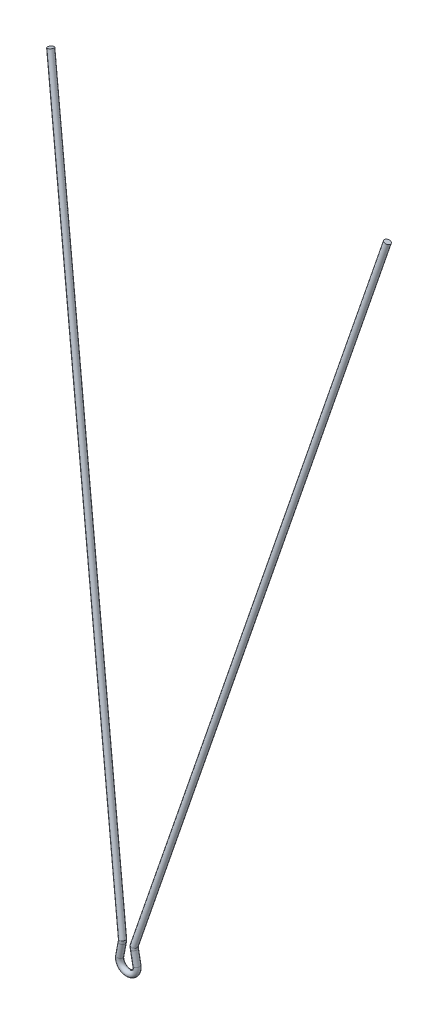
ISO-10303-21;
HEADER;
FILE_DESCRIPTION(('STEP AP214'),'2;1');
FILE_NAME('part.step','',(''),(''),'','','');
FILE_SCHEMA(('AUTOMOTIVE_DESIGN { 1 0 10303 214 1 1 1 1 }'));
ENDSEC;
DATA;
#1=APPLICATION_CONTEXT('core data for automotive mechanical design processes');
#2=APPLICATION_PROTOCOL_DEFINITION('international standard','automotive_design',2000,#1);
#3=PRODUCT_CONTEXT('',#1,'mechanical');
#4=PRODUCT('Part','Part','',(#3));
#5=PRODUCT_RELATED_PRODUCT_CATEGORY('part','',(#4));
#6=PRODUCT_DEFINITION_FORMATION('','',#4);
#7=PRODUCT_DEFINITION_CONTEXT('part definition',#1,'design');
#8=PRODUCT_DEFINITION('design','',#6,#7);
#9=PRODUCT_DEFINITION_SHAPE('','',#8);
#10=(LENGTH_UNIT() NAMED_UNIT(*) SI_UNIT(.MILLI.,.METRE.));
#11=(NAMED_UNIT(*) PLANE_ANGLE_UNIT() SI_UNIT($,.RADIAN.));
#12=(NAMED_UNIT(*) SI_UNIT($,.STERADIAN.) SOLID_ANGLE_UNIT());
#13=UNCERTAINTY_MEASURE_WITH_UNIT(LENGTH_MEASURE(1.E-05),#10,'distance_accuracy_value','');
#14=(GEOMETRIC_REPRESENTATION_CONTEXT(3) GLOBAL_UNCERTAINTY_ASSIGNED_CONTEXT((#13)) GLOBAL_UNIT_ASSIGNED_CONTEXT((#10,
#11,#12)) REPRESENTATION_CONTEXT('',''));
#15=CARTESIAN_POINT('',(0.,0.,0.));
#16=DIRECTION('',(0.,0.,1.));
#17=DIRECTION('',(1.,0.,0.));
#18=AXIS2_PLACEMENT_3D('',#15,#16,#17);
#19=CARTESIAN_POINT('',(-4.42141359605702,0.837318226603323,0.));
#20=DIRECTION('',(0.186070717022958,0.98253635467934,0.));
#21=DIRECTION('',(-0.98253635467934,0.186070717022958,0.));
#22=AXIS2_PLACEMENT_3D('',#19,#20,#21);
#23=CYLINDRICAL_SURFACE('',#22,1.5);
#24=CARTESIAN_POINT('',(-4.42141359605702,0.837318226603323,0.));
#25=DIRECTION('',(-0.18607071702296,-0.982536354679339,0.));
#26=DIRECTION('',(0.,0.,-1.));
#27=AXIS2_PLACEMENT_3D('',#24,#25,#26);
#28=CIRCLE('',#27,1.5);
#29=CARTESIAN_POINT('',(-5.89521812807603,1.11642430213776,0.));
#30=VERTEX_POINT('',#29);
#31=EDGE_CURVE('E10',#30,#30,#28,.T.);
#32=ORIENTED_EDGE('',*,*,#31,.F.);
#33=EDGE_LOOP('',(#32));
#34=FACE_BOUND('',#33,.T.);
#35=CARTESIAN_POINT('',(-3.12224551724466,7.69750498083926,0.));
#36=DIRECTION('',(-0.18607071702296,-0.982536354679339,0.));
#37=DIRECTION('',(0.,0.,-1.));
#38=AXIS2_PLACEMENT_3D('',#35,#36,#37);
#39=CIRCLE('',#38,1.5);
#40=CARTESIAN_POINT('',(-3.12224551724466,7.69750498083926,-1.50000000000004));
#41=VERTEX_POINT('',#40);
#42=EDGE_CURVE('E35',#41,#41,#39,.T.);
#43=ORIENTED_EDGE('',*,*,#42,.T.);
#44=EDGE_LOOP('',(#43));
#45=FACE_BOUND('',#44,.T.);
#46=ADVANCED_FACE('F29',(#34,#45),#23,.T.);
#47=CARTESIAN_POINT('',(0.,0.,0.));
#48=DIRECTION('',(0.,0.,1.));
#49=DIRECTION('',(1.,0.,0.));
#50=AXIS2_PLACEMENT_3D('',#47,#48,#49);
#51=TOROIDAL_SURFACE('',#50,4.5,1.5);
#52=CARTESIAN_POINT('',(4.42141359605697,0.837318226603212,0.));
#53=DIRECTION('',(-0.18607071702296,0.982536354679339,0.));
#54=DIRECTION('',(0.,0.,-1.));
#55=AXIS2_PLACEMENT_3D('',#52,#53,#54);
#56=CIRCLE('',#55,1.5);
#57=CARTESIAN_POINT('',(5.89521812807605,1.11642430213763,0.));
#58=VERTEX_POINT('',#57);
#59=EDGE_CURVE('E56',#58,#58,#56,.T.);
#60=CARTESIAN_POINT('',(0.,0.,0.));
#61=DIRECTION('',(0.,0.,1.));
#62=DIRECTION('',(1.,0.,0.));
#63=AXIS2_PLACEMENT_3D('',#60,#61,#62);
#64=CIRCLE('',#63,6.);
#65=EDGE_CURVE('',#30,#58,#64,.T.);
#66=ORIENTED_EDGE('',*,*,#31,.T.);
#67=ORIENTED_EDGE('',*,*,#59,.F.);
#68=ORIENTED_EDGE('',*,*,#65,.T.);
#69=ORIENTED_EDGE('',*,*,#65,.F.);
#70=EDGE_LOOP('',(#66,#68,#67,#69));
#71=FACE_BOUND('',#70,.T.);
#72=ADVANCED_FACE('F89',(#71),#51,.T.);
#73=CARTESIAN_POINT('',(-3.12224551724466,7.69750498083921,-1.50000000000004));
#74=CARTESIAN_POINT('',(-3.09753527008533,7.82798610412144,-1.50000000000004));
#75=CARTESIAN_POINT('',(-3.05694697284126,8.07293599759351,-1.50000000000006));
#76=CARTESIAN_POINT('',(-3.01033102219039,8.56531309695108,-1.49999999999997));
#77=CARTESIAN_POINT('',(-3.,8.71745364408555,-1.50000000000025));
#78=CARTESIAN_POINT('',(-2.99999999999995,8.89669872727467,-1.50000000000025));
#79=CARTESIAN_POINT('',(-0.174636453206561,7.13929282977048,-1.50000000000003));
#80=CARTESIAN_POINT('',(-0.149926206047285,7.2697739530525,-1.50000000000003));
#81=CARTESIAN_POINT('',(-0.0767177589849621,7.72923151361028,-1.49999999999999));
#82=CARTESIAN_POINT('',(-0.0167989694493387,8.25151540603849,-1.5000000000002));
#83=CARTESIAN_POINT('',(0.,8.98435932243366,-1.49999999999949));
#84=CARTESIAN_POINT('',(0.,9.2668262855756,-1.49999999999949));
#85=CARTESIAN_POINT('',(-0.174636453206561,7.13929282977052,1.49999999999997));
#86=CARTESIAN_POINT('',(-0.149926206047285,7.2697739530525,1.49999999999997));
#87=CARTESIAN_POINT('',(-0.0767177589848789,7.74470362085609,1.50000000000004));
#88=CARTESIAN_POINT('',(-0.0167989694492138,8.18958740647185,1.49999999999968));
#89=CARTESIAN_POINT('',(-2.08166817117217E-13,9.19096186788426,1.50000000000094));
#90=CARTESIAN_POINT('',(-1.66533453693773E-13,9.47342883102628,1.50000000000094));
#91=CARTESIAN_POINT('',(-3.12224551724466,7.69750498083926,1.49999999999996));
#92=CARTESIAN_POINT('',(-3.09753527008533,7.82798610412144,1.49999999999996));
#93=CARTESIAN_POINT('',(-3.05694697284142,8.08454305082168,1.49999999999997));
#94=CARTESIAN_POINT('',(-3.01033102219034,8.51885519849832,1.4999999999999));
#95=CARTESIAN_POINT('',(-3.00000000000006,8.87244524955982,1.50000000000017));
#96=CARTESIAN_POINT('',(-3.00000000000006,9.10330127272529,1.50000000000017));
#97=CARTESIAN_POINT('',(-6.06985458128265,8.25571713190823,1.5));
#98=CARTESIAN_POINT('',(-6.04514433412329,8.3861982551903,1.5));
#99=CARTESIAN_POINT('',(-6.03717618669783,8.4243824807873,1.49999999999996));
#100=CARTESIAN_POINT('',(-6.00386307493136,8.84812299052484,1.50000000000017));
#101=CARTESIAN_POINT('',(-5.99999999999988,8.55392863123538,1.49999999999946));
#102=CARTESIAN_POINT('',(-5.99999999999988,8.73317371442442,1.49999999999946));
#103=CARTESIAN_POINT('',(-6.06985458128265,8.25571713190823,-1.5));
#104=CARTESIAN_POINT('',(-6.04514433412329,8.3861982551903,-1.5));
#105=CARTESIAN_POINT('',(-6.03717618669779,8.416640481577,-1.50000000000007));
#106=CARTESIAN_POINT('',(-6.00386307493141,8.8791107878638,-1.49999999999971));
#107=CARTESIAN_POINT('',(-5.99999999999975,8.45054796573777,-1.50000000000097));
#108=CARTESIAN_POINT('',(-5.9999999999998,8.52657116897377,-1.50000000000097));
#109=CARTESIAN_POINT('',(-3.12224551724466,7.69750498083921,-1.50000000000004));
#110=CARTESIAN_POINT('',(-3.09753527008533,7.82798610412144,-1.50000000000004));
#111=CARTESIAN_POINT('',(-3.05694697284126,8.07293599759351,-1.50000000000006));
#112=CARTESIAN_POINT('',(-3.01033102219039,8.56531309695108,-1.49999999999997));
#113=CARTESIAN_POINT('',(-3.,8.71745364408555,-1.50000000000025));
#114=CARTESIAN_POINT('',(-2.99999999999995,8.89669872727467,-1.50000000000025));
#115=(BOUNDED_SURFACE() B_SPLINE_SURFACE(3,3,((#73,#74,#75,#76,#77,#78),(#79,#80,#81,#82,#83,
#84),(#85,#86,#87,#88,#89,#90),(#91,#92,#93,#94,#95,#96),(#97,#98,#99,#100,#101,#102),(#103,
#104,#105,#106,#107,#108),(#109,#110,#111,#112,#113,#114)),.UNSPECIFIED.,.T.,.F.,
.F.) B_SPLINE_SURFACE_WITH_KNOTS((4,3,4),(4,1,1,4),(0.,0.5,1.),(0.,0.296659076013761,
0.574980972124963,1.),
.UNSPECIFIED.) GEOMETRIC_REPRESENTATION_ITEM() RATIONAL_B_SPLINE_SURFACE(((1.,1.,1.,1.,1.,1.),
(0.333333333333333,0.333333333333333,0.333333333333333,0.333333333333333,0.333333333333333,
0.333333333333333),(0.333333333333333,0.333333333333333,0.333333333333333,0.333333333333333,
0.333333333333333,0.333333333333333),(1.,1.,1.,1.,1.,1.),(0.333333333333333,0.333333333333333,
0.333333333333333,0.333333333333333,0.333333333333333,0.333333333333333),(0.333333333333333,
0.333333333333333,0.333333333333333,0.333333333333333,0.333333333333333,0.333333333333333),(1.,
1.,1.,1.,1.,1.))) REPRESENTATION_ITEM('') SURFACE());
#116=CARTESIAN_POINT('',(-2.99999999999995,8.89669872727467,-1.50000000000025));
#117=CARTESIAN_POINT('',(0.,9.2668262855756,-1.49999999999949));
#118=CARTESIAN_POINT('',(-1.66533453693773E-13,9.47342883102628,1.50000000000094));
#119=CARTESIAN_POINT('',(-3.00000000000006,9.10330127272529,1.50000000000017));
#120=CARTESIAN_POINT('',(-5.99999999999988,8.73317371442442,1.49999999999946));
#121=CARTESIAN_POINT('',(-5.9999999999998,8.52657116897377,-1.50000000000097));
#122=CARTESIAN_POINT('',(-2.99999999999995,8.89669872727467,-1.50000000000025));
#123=(BOUNDED_CURVE() B_SPLINE_CURVE(3,(#116,#117,#118,#119,#120,#121,#122),.UNSPECIFIED.,.T.,
.F.) B_SPLINE_CURVE_WITH_KNOTS((4,3,4),(0.,0.5,1.),
.UNSPECIFIED.) CURVE() GEOMETRIC_REPRESENTATION_ITEM() RATIONAL_B_SPLINE_CURVE((1.,
0.333333333333333,0.333333333333333,1.,0.333333333333333,0.333333333333333,1.)) REPRESENTATION_ITEM(''));
#124=CARTESIAN_POINT('',(-2.99999999999995,8.89669872727467,-1.50000000000025));
#125=VERTEX_POINT('',#124);
#126=EDGE_CURVE('E39',#125,#125,#123,.F.);
#127=ORIENTED_EDGE('',*,*,#42,.F.);
#128=EDGE_LOOP('',(#127));
#129=FACE_BOUND('',#128,.T.);
#130=ORIENTED_EDGE('',*,*,#126,.F.);
#131=EDGE_LOOP('',(#130));
#132=FACE_BOUND('',#131,.T.);
#133=ADVANCED_FACE('F95',(#129,#132),#115,.F.);
#134=CARTESIAN_POINT('',(-86.6394289124935,341.298059965422,-45.1869286704309));
#135=DIRECTION('',(0.241921895599681,-0.960852874967529,0.135039065074123));
#136=DIRECTION('',(0.969735384242687,0.244158318612518,0.));
#137=AXIS2_PLACEMENT_3D('',#134,#135,#136);
#138=PLANE('',#137);
#139=CARTESIAN_POINT('',(-86.6144380727778,341.095501367811,-46.6729789631413));
#140=DIRECTION('',(0.241921895599681,-0.960852874967529,0.135039065074123));
#141=DIRECTION('',(0.969735384242687,0.244158318612518,0.));
#142=AXIS2_PLACEMENT_3D('',#139,#140,#141);
#143=CIRCLE('',#142,1.50000000000021);
#144=CARTESIAN_POINT('',(-85.1598349964136,341.461738845729,-46.6729789631413));
#145=VERTEX_POINT('',#144);
#146=EDGE_CURVE('E43',#145,#145,#143,.T.);
#147=ORIENTED_EDGE('',*,*,#146,.F.);
#148=EDGE_LOOP('',(#147));
#149=FACE_BOUND('',#148,.T.);
#150=ADVANCED_FACE('F101',(#149),#138,.F.);
#151=CARTESIAN_POINT('',(-2.99999999999995,8.89669872727467,-1.50000000000025));
#152=CARTESIAN_POINT('',(-86.5894472330622,340.892942770199,-48.1590292558517));
#153=CARTESIAN_POINT('',(-5.9999999999998,8.52657116897377,-1.50000000000097));
#154=CARTESIAN_POINT('',(-89.4999052725442,340.1671770834,-48.1090475764214));
#155=CARTESIAN_POINT('',(-5.99999999999988,8.73317371442442,1.49999999999946));
#156=CARTESIAN_POINT('',(-89.5498869519753,340.572294278622,-45.1369469910005));
#157=CARTESIAN_POINT('',(-3.00000000000006,9.10330127272529,1.50000000000017));
#158=CARTESIAN_POINT('',(-86.6394289124935,341.298059965422,-45.1869286704309));
#159=CARTESIAN_POINT('',(-1.66533453693773E-13,9.47342883102628,1.50000000000094));
#160=CARTESIAN_POINT('',(-83.7289708730113,342.023825652221,-45.2369103498613));
#161=CARTESIAN_POINT('',(0.,9.2668262855756,-1.49999999999949));
#162=CARTESIAN_POINT('',(-83.6789891935801,341.618708456998,-48.2090109352821));
#163=CARTESIAN_POINT('',(-2.99999999999995,8.89669872727467,-1.50000000000025));
#164=CARTESIAN_POINT('',(-86.5894472330622,340.892942770199,-48.1590292558517));
#165=(BOUNDED_SURFACE() B_SPLINE_SURFACE(3,1,((#151,#152),(#153,#154),(#155,#156),(#157,#158),
(#159,#160),(#161,#162),(#163,#164)),.UNSPECIFIED.,.T.,.F.,.F.) B_SPLINE_SURFACE_WITH_KNOTS((4,
3,4),(2,2),(0.,0.5,1.),(0.,1.),
.UNSPECIFIED.) GEOMETRIC_REPRESENTATION_ITEM() RATIONAL_B_SPLINE_SURFACE(((1.,1.),
(0.333333333333333,0.333333333333333),(0.333333333333333,0.333333333333333),(1.,1.),
(0.333333333333333,0.333333333333333),(0.333333333333333,0.333333333333333),(1.,1.))) REPRESENTATION_ITEM('') SURFACE());
#166=ORIENTED_EDGE('',*,*,#126,.T.);
#167=EDGE_LOOP('',(#166));
#168=FACE_BOUND('',#167,.T.);
#169=ORIENTED_EDGE('',*,*,#146,.T.);
#170=EDGE_LOOP('',(#169));
#171=FACE_BOUND('',#170,.T.);
#172=ADVANCED_FACE('F104',(#168,#171),#165,.T.);
#173=CARTESIAN_POINT('',(4.42141359605697,0.837318226603212,0.));
#174=DIRECTION('',(-0.186070717022958,0.98253635467934,0.));
#175=DIRECTION('',(-0.98253635467934,-0.186070717022958,0.));
#176=AXIS2_PLACEMENT_3D('',#173,#174,#175);
#177=CYLINDRICAL_SURFACE('',#176,1.5);
#178=ORIENTED_EDGE('',*,*,#59,.T.);
#179=EDGE_LOOP('',(#178));
#180=FACE_BOUND('',#179,.T.);
#181=CARTESIAN_POINT('',(3.1222455172446,7.69750498083932,0.));
#182=DIRECTION('',(-0.18607071702296,0.982536354679339,0.));
#183=DIRECTION('',(0.,0.,-1.));
#184=AXIS2_PLACEMENT_3D('',#181,#182,#183);
#185=CIRCLE('',#184,1.5);
#186=CARTESIAN_POINT('',(3.1222455172446,7.69750498083932,-1.5));
#187=VERTEX_POINT('',#186);
#188=EDGE_CURVE('E53',#187,#187,#185,.T.);
#189=ORIENTED_EDGE('',*,*,#188,.F.);
#190=EDGE_LOOP('',(#189));
#191=FACE_BOUND('',#190,.T.);
#192=ADVANCED_FACE('F85',(#180,#191),#177,.T.);
#193=CARTESIAN_POINT('',(3.1222455172446,7.69750498083932,-1.5));
#194=CARTESIAN_POINT('',(3.09753527008544,7.82798610412133,-1.5));
#195=CARTESIAN_POINT('',(3.05694697284154,8.07293599759357,-1.50000000000002));
#196=CARTESIAN_POINT('',(3.01033102219034,8.56531309695113,-1.49999999999993));
#197=CARTESIAN_POINT('',(2.99999999999995,8.71745364408561,-1.50000000000021));
#198=CARTESIAN_POINT('',(3.,8.89669872727472,-1.50000000000021));
#199=CARTESIAN_POINT('',(0.174636453206645,7.13929282977044,-1.50000000000003));
#200=CARTESIAN_POINT('',(0.149926206047327,7.26977395305255,-1.50000000000003));
#201=CARTESIAN_POINT('',(0.0767177589850038,7.72923151361032,-1.49999999999999));
#202=CARTESIAN_POINT('',(0.0167989694493387,8.25151540603849,-1.5000000000002));
#203=CARTESIAN_POINT('',(1.2490009027033E-13,8.98435932243362,-1.49999999999949));
#204=CARTESIAN_POINT('',(1.66533453693773E-13,9.2668262855756,-1.49999999999949));
#205=CARTESIAN_POINT('',(0.174636453206645,7.13929282977044,1.49999999999997));
#206=CARTESIAN_POINT('',(0.149926206047327,7.26977395305255,1.49999999999997));
#207=CARTESIAN_POINT('',(0.0767177589849621,7.74470362085609,1.50000000000004));
#208=CARTESIAN_POINT('',(0.0167989694493387,8.18958740647177,1.49999999999968));
#209=CARTESIAN_POINT('',(2.4980018054066E-13,9.19096186788426,1.50000000000094));
#210=CARTESIAN_POINT('',(2.4980018054066E-13,9.47342883102628,1.50000000000094));
#211=CARTESIAN_POINT('',(3.1222455172446,7.69750498083932,1.5));
#212=CARTESIAN_POINT('',(3.09753527008544,7.82798610412139,1.5));
#213=CARTESIAN_POINT('',(3.05694697284148,8.08454305082157,1.50000000000002));
#214=CARTESIAN_POINT('',(3.01033102219039,8.51885519849821,1.49999999999995));
#215=CARTESIAN_POINT('',(3.00000000000006,8.87244524955977,1.50000000000021));
#216=CARTESIAN_POINT('',(3.00000000000006,9.10330127272529,1.50000000000021));
#217=CARTESIAN_POINT('',(6.06985458128265,8.25571713190823,1.5));
#218=CARTESIAN_POINT('',(6.04514433412337,8.38619825519038,1.5));
#219=CARTESIAN_POINT('',(6.03717618669783,8.42438248078722,1.49999999999996));
#220=CARTESIAN_POINT('',(6.00386307493145,8.84812299052492,1.50000000000017));
#221=CARTESIAN_POINT('',(5.99999999999992,8.55392863123534,1.49999999999946));
#222=CARTESIAN_POINT('',(5.99999999999996,8.73317371442446,1.49999999999946));
#223=CARTESIAN_POINT('',(6.06985458128269,8.25571713190823,-1.5));
#224=CARTESIAN_POINT('',(6.04514433412341,8.3861982551903,-1.5));
#225=CARTESIAN_POINT('',(6.03717618669787,8.41664048157692,-1.50000000000007));
#226=CARTESIAN_POINT('',(6.00386307493145,8.87911078786384,-1.49999999999971));
#227=CARTESIAN_POINT('',(5.9999999999998,8.45054796573777,-1.50000000000097));
#228=CARTESIAN_POINT('',(5.99999999999988,8.52657116897377,-1.50000000000097));
#229=CARTESIAN_POINT('',(3.1222455172446,7.69750498083932,-1.5));
#230=CARTESIAN_POINT('',(3.09753527008544,7.82798610412133,-1.5));
#231=CARTESIAN_POINT('',(3.05694697284154,8.07293599759357,-1.50000000000002));
#232=CARTESIAN_POINT('',(3.01033102219034,8.56531309695113,-1.49999999999993));
#233=CARTESIAN_POINT('',(2.99999999999995,8.71745364408561,-1.50000000000021));
#234=CARTESIAN_POINT('',(3.,8.89669872727472,-1.50000000000021));
#235=(BOUNDED_SURFACE() B_SPLINE_SURFACE(3,3,((#193,#194,#195,#196,#197,#198),(#199,#200,#201,
#202,#203,#204),(#205,#206,#207,#208,#209,#210),(#211,#212,#213,#214,#215,#216),(#217,#218,#219,
#220,#221,#222),(#223,#224,#225,#226,#227,#228),(#229,#230,#231,#232,#233,#234)),.UNSPECIFIED.,
.T.,.F.,.F.) B_SPLINE_SURFACE_WITH_KNOTS((4,3,4),(4,1,1,4),(0.,0.5,1.),(0.,0.296659076013761,
0.574980972124963,1.),
.UNSPECIFIED.) GEOMETRIC_REPRESENTATION_ITEM() RATIONAL_B_SPLINE_SURFACE(((1.,1.,1.,1.,1.,1.),
(0.333333333333333,0.333333333333333,0.333333333333333,0.333333333333333,0.333333333333333,
0.333333333333333),(0.333333333333333,0.333333333333333,0.333333333333333,0.333333333333333,
0.333333333333333,0.333333333333333),(1.,1.,1.,1.,1.,1.),(0.333333333333333,0.333333333333333,
0.333333333333333,0.333333333333333,0.333333333333333,0.333333333333333),(0.333333333333333,
0.333333333333333,0.333333333333333,0.333333333333333,0.333333333333333,0.333333333333333),(1.,
1.,1.,1.,1.,1.))) REPRESENTATION_ITEM('') SURFACE());
#236=CARTESIAN_POINT('',(3.,8.89669872727472,-1.50000000000021));
#237=CARTESIAN_POINT('',(5.99999999999988,8.52657116897377,-1.50000000000097));
#238=CARTESIAN_POINT('',(5.99999999999996,8.73317371442446,1.49999999999946));
#239=CARTESIAN_POINT('',(2.99999999999995,9.10330127272524,1.50000000000021));
#240=CARTESIAN_POINT('',(2.4980018054066E-13,9.47342883102628,1.50000000000094));
#241=CARTESIAN_POINT('',(1.66533453693773E-13,9.2668262855756,-1.49999999999949));
#242=CARTESIAN_POINT('',(3.,8.89669872727472,-1.50000000000021));
#243=(BOUNDED_CURVE() B_SPLINE_CURVE(3,(#236,#237,#238,#239,#240,#241,#242),.UNSPECIFIED.,.T.,
.F.) B_SPLINE_CURVE_WITH_KNOTS((4,3,4),(0.,0.5,1.),
.UNSPECIFIED.) CURVE() GEOMETRIC_REPRESENTATION_ITEM() RATIONAL_B_SPLINE_CURVE((1.,
0.333333333333333,0.333333333333333,1.,0.333333333333333,0.333333333333333,1.)) REPRESENTATION_ITEM(''));
#244=CARTESIAN_POINT('',(3.,8.89669872727472,-1.50000000000021));
#245=VERTEX_POINT('',#244);
#246=EDGE_CURVE('E62',#245,#245,#243,.T.);
#247=ORIENTED_EDGE('',*,*,#188,.T.);
#248=EDGE_LOOP('',(#247));
#249=FACE_BOUND('',#248,.T.);
#250=ORIENTED_EDGE('',*,*,#246,.T.);
#251=EDGE_LOOP('',(#250));
#252=FACE_BOUND('',#251,.T.);
#253=ADVANCED_FACE('F71',(#249,#252),#235,.T.);
#254=CARTESIAN_POINT('',(86.6394289124935,341.298059965421,-45.1869286704309));
#255=DIRECTION('',(0.241921895599681,0.96085287496753,-0.135039065074124));
#256=DIRECTION('',(-0.969735384242687,0.244158318612518,0.));
#257=AXIS2_PLACEMENT_3D('',#254,#255,#256);
#258=PLANE('',#257);
#259=CARTESIAN_POINT('',(86.6144380727779,341.09550136781,-46.6729789631413));
#260=DIRECTION('',(0.241921895599681,0.96085287496753,-0.135039065074124));
#261=DIRECTION('',(-0.969735384242687,0.244158318612518,0.));
#262=AXIS2_PLACEMENT_3D('',#259,#260,#261);
#263=CIRCLE('',#262,1.50000000000021);
#264=CARTESIAN_POINT('',(85.1598349964136,341.461738845729,-46.6729789631413));
#265=VERTEX_POINT('',#264);
#266=EDGE_CURVE('E59',#265,#265,#263,.T.);
#267=ORIENTED_EDGE('',*,*,#266,.T.);
#268=EDGE_LOOP('',(#267));
#269=FACE_BOUND('',#268,.T.);
#270=ADVANCED_FACE('F76',(#269),#258,.T.);
#271=CARTESIAN_POINT('',(3.,8.89669872727472,-1.50000000000021));
#272=CARTESIAN_POINT('',(86.5894472330623,340.892942770199,-48.1590292558517));
#273=CARTESIAN_POINT('',(5.99999999999988,8.52657116897377,-1.50000000000097));
#274=CARTESIAN_POINT('',(89.4999052725443,340.1671770834,-48.1090475764214));
#275=CARTESIAN_POINT('',(5.99999999999996,8.73317371442446,1.49999999999946));
#276=CARTESIAN_POINT('',(89.5498869519756,340.572294278623,-45.1369469910005));
#277=CARTESIAN_POINT('',(2.99999999999995,9.10330127272524,1.50000000000021));
#278=CARTESIAN_POINT('',(86.6394289124935,341.298059965421,-45.1869286704309));
#279=CARTESIAN_POINT('',(2.4980018054066E-13,9.47342883102628,1.50000000000094));
#280=CARTESIAN_POINT('',(83.7289708730115,342.023825652221,-45.2369103498613));
#281=CARTESIAN_POINT('',(1.66533453693773E-13,9.2668262855756,-1.49999999999949));
#282=CARTESIAN_POINT('',(83.6789891935803,341.618708456998,-48.2090109352821));
#283=CARTESIAN_POINT('',(3.,8.89669872727472,-1.50000000000021));
#284=CARTESIAN_POINT('',(86.5894472330623,340.892942770199,-48.1590292558517));
#285=(BOUNDED_SURFACE() B_SPLINE_SURFACE(3,1,((#271,#272),(#273,#274),(#275,#276),(#277,#278),
(#279,#280),(#281,#282),(#283,#284)),.UNSPECIFIED.,.T.,.F.,.F.) B_SPLINE_SURFACE_WITH_KNOTS((4,
3,4),(2,2),(0.,0.5,1.),(0.,1.),
.UNSPECIFIED.) GEOMETRIC_REPRESENTATION_ITEM() RATIONAL_B_SPLINE_SURFACE(((1.,1.),
(0.333333333333333,0.333333333333333),(0.333333333333333,0.333333333333333),(1.,1.),
(0.333333333333333,0.333333333333333),(0.333333333333333,0.333333333333333),(1.,1.))) REPRESENTATION_ITEM('') SURFACE());
#286=ORIENTED_EDGE('',*,*,#246,.F.);
#287=EDGE_LOOP('',(#286));
#288=FACE_BOUND('',#287,.T.);
#289=ORIENTED_EDGE('',*,*,#266,.F.);
#290=EDGE_LOOP('',(#289));
#291=FACE_BOUND('',#290,.T.);
#292=ADVANCED_FACE('F73',(#288,#291),#285,.F.);
#293=CLOSED_SHELL('',(#46,#72,#133,#150,#172,#192,#253,#270,#292));
#294=MANIFOLD_SOLID_BREP('B2',#293);
#295=ADVANCED_BREP_SHAPE_REPRESENTATION('',(#18,#294),#14);
#296=SHAPE_DEFINITION_REPRESENTATION(#9,#295);
ENDSEC;
END-ISO-10303-21;
